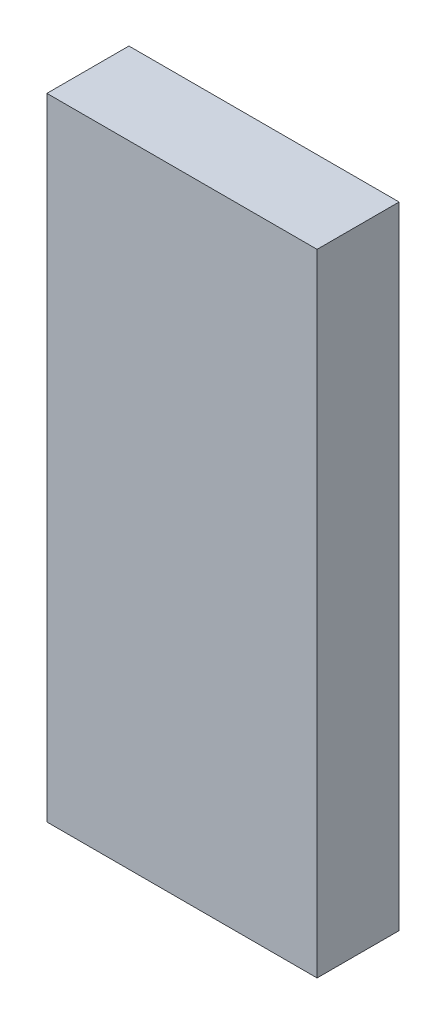
ISO-10303-21;
HEADER;
FILE_DESCRIPTION(('STEP AP214'),'2;1');
FILE_NAME('part.step','',(''),(''),'','','');
FILE_SCHEMA(('AUTOMOTIVE_DESIGN { 1 0 10303 214 1 1 1 1 }'));
ENDSEC;
DATA;
#1=APPLICATION_CONTEXT('core data for automotive mechanical design processes');
#2=APPLICATION_PROTOCOL_DEFINITION('international standard','automotive_design',2000,#1);
#3=PRODUCT_CONTEXT('',#1,'mechanical');
#4=PRODUCT('Part','Part','',(#3));
#5=PRODUCT_RELATED_PRODUCT_CATEGORY('part','',(#4));
#6=PRODUCT_DEFINITION_FORMATION('','',#4);
#7=PRODUCT_DEFINITION_CONTEXT('part definition',#1,'design');
#8=PRODUCT_DEFINITION('design','',#6,#7);
#9=PRODUCT_DEFINITION_SHAPE('','',#8);
#10=(LENGTH_UNIT() NAMED_UNIT(*) SI_UNIT(.MILLI.,.METRE.));
#11=(NAMED_UNIT(*) PLANE_ANGLE_UNIT() SI_UNIT($,.RADIAN.));
#12=(NAMED_UNIT(*) SI_UNIT($,.STERADIAN.) SOLID_ANGLE_UNIT());
#13=UNCERTAINTY_MEASURE_WITH_UNIT(LENGTH_MEASURE(1.E-05),#10,'distance_accuracy_value','');
#14=(GEOMETRIC_REPRESENTATION_CONTEXT(3) GLOBAL_UNCERTAINTY_ASSIGNED_CONTEXT((#13)) GLOBAL_UNIT_ASSIGNED_CONTEXT((#10,
#11,#12)) REPRESENTATION_CONTEXT('',''));
#15=CARTESIAN_POINT('',(0.,0.,0.));
#16=DIRECTION('',(0.,0.,1.));
#17=DIRECTION('',(1.,0.,0.));
#18=AXIS2_PLACEMENT_3D('',#15,#16,#17);
#19=CARTESIAN_POINT('',(0.70000114,-1.634998,0.42499788));
#20=DIRECTION('',(0.,0.,-1.));
#21=DIRECTION('',(0.,-1.,0.));
#22=AXIS2_PLACEMENT_3D('',#19,#20,#21);
#23=PLANE('',#22);
#24=DIRECTION('',(0.,1.,0.));
#25=VECTOR('',#24,1.);
#26=CARTESIAN_POINT('',(0.70000114,-1.634998,0.42499788));
#27=LINE('',#26,#25);
#28=CARTESIAN_POINT('',(0.70000114,-1.634998,0.42499788));
#29=VERTEX_POINT('',#28);
#30=CARTESIAN_POINT('',(0.70000114,1.63500054,0.42499788));
#31=VERTEX_POINT('',#30);
#32=EDGE_CURVE('E81',#29,#31,#27,.T.);
#33=ORIENTED_EDGE('',*,*,#32,.T.);
#34=DIRECTION('',(-1.,0.,0.));
#35=VECTOR('',#34,1.);
#36=CARTESIAN_POINT('',(0.70000114,1.63500054,0.42499788));
#37=LINE('',#36,#35);
#38=CARTESIAN_POINT('',(-0.70000114,1.63500054,0.42499788));
#39=VERTEX_POINT('',#38);
#40=EDGE_CURVE('E79',#31,#39,#37,.T.);
#41=ORIENTED_EDGE('',*,*,#40,.T.);
#42=DIRECTION('',(0.,-1.,0.));
#43=VECTOR('',#42,1.);
#44=CARTESIAN_POINT('',(-0.70000114,1.63500054,0.42499788));
#45=LINE('',#44,#43);
#46=CARTESIAN_POINT('',(-0.70000114,-1.634998,0.42499788));
#47=VERTEX_POINT('',#46);
#48=EDGE_CURVE('E68',#39,#47,#45,.T.);
#49=ORIENTED_EDGE('',*,*,#48,.T.);
#50=DIRECTION('',(1.,0.,0.));
#51=VECTOR('',#50,1.);
#52=CARTESIAN_POINT('',(-0.70000114,-1.634998,0.42499788));
#53=LINE('',#52,#51);
#54=EDGE_CURVE('E11',#47,#29,#53,.T.);
#55=ORIENTED_EDGE('',*,*,#54,.T.);
#56=EDGE_LOOP('',(#33,#41,#49,#55));
#57=FACE_BOUND('',#56,.T.);
#58=ADVANCED_FACE('F17',(#57),#23,.F.);
#59=CARTESIAN_POINT('',(0.70000114,-1.634998,0.));
#60=DIRECTION('',(0.,0.,-1.));
#61=DIRECTION('',(0.,-1.,0.));
#62=AXIS2_PLACEMENT_3D('',#59,#60,#61);
#63=PLANE('',#62);
#64=DIRECTION('',(0.,1.,0.));
#65=VECTOR('',#64,1.);
#66=CARTESIAN_POINT('',(0.70000114,-1.634998,0.));
#67=LINE('',#66,#65);
#68=CARTESIAN_POINT('',(0.70000114,-1.634998,0.));
#69=VERTEX_POINT('',#68);
#70=CARTESIAN_POINT('',(0.70000114,1.63500054,0.));
#71=VERTEX_POINT('',#70);
#72=EDGE_CURVE('E102',#69,#71,#67,.T.);
#73=ORIENTED_EDGE('',*,*,#72,.F.);
#74=DIRECTION('',(1.,0.,0.));
#75=VECTOR('',#74,1.);
#76=CARTESIAN_POINT('',(-0.70000114,-1.634998,0.));
#77=LINE('',#76,#75);
#78=CARTESIAN_POINT('',(-0.70000114,-1.634998,0.));
#79=VERTEX_POINT('',#78);
#80=EDGE_CURVE('E28',#79,#69,#77,.T.);
#81=ORIENTED_EDGE('',*,*,#80,.F.);
#82=DIRECTION('',(0.,-1.,0.));
#83=VECTOR('',#82,1.);
#84=CARTESIAN_POINT('',(-0.70000114,1.63500054,0.));
#85=LINE('',#84,#83);
#86=CARTESIAN_POINT('',(-0.70000114,1.63500054,0.));
#87=VERTEX_POINT('',#86);
#88=EDGE_CURVE('E86',#87,#79,#85,.T.);
#89=ORIENTED_EDGE('',*,*,#88,.F.);
#90=DIRECTION('',(-1.,0.,0.));
#91=VECTOR('',#90,1.);
#92=CARTESIAN_POINT('',(0.70000114,1.63500054,0.));
#93=LINE('',#92,#91);
#94=EDGE_CURVE('E89',#71,#87,#93,.T.);
#95=ORIENTED_EDGE('',*,*,#94,.F.);
#96=EDGE_LOOP('',(#73,#81,#89,#95));
#97=FACE_BOUND('',#96,.T.);
#98=ADVANCED_FACE('F121',(#97),#63,.T.);
#99=CARTESIAN_POINT('',(-0.70000114,-1.634998,0.));
#100=DIRECTION('',(0.,1.,0.));
#101=DIRECTION('',(1.,0.,0.));
#102=AXIS2_PLACEMENT_3D('',#99,#100,#101);
#103=PLANE('',#102);
#104=DIRECTION('',(0.,0.,1.));
#105=VECTOR('',#104,1.);
#106=CARTESIAN_POINT('',(-0.70000114,-1.634998,0.));
#107=LINE('',#106,#105);
#108=EDGE_CURVE('E21',#79,#47,#107,.T.);
#109=ORIENTED_EDGE('',*,*,#108,.F.);
#110=ORIENTED_EDGE('',*,*,#80,.T.);
#111=DIRECTION('',(0.,0.,1.));
#112=VECTOR('',#111,1.);
#113=CARTESIAN_POINT('',(0.70000114,-1.634998,0.));
#114=LINE('',#113,#112);
#115=EDGE_CURVE('E100',#69,#29,#114,.T.);
#116=ORIENTED_EDGE('',*,*,#115,.T.);
#117=ORIENTED_EDGE('',*,*,#54,.F.);
#118=EDGE_LOOP('',(#109,#110,#116,#117));
#119=FACE_BOUND('',#118,.T.);
#120=ADVANCED_FACE('F163',(#119),#103,.F.);
#121=CARTESIAN_POINT('',(-0.70000114,1.63500054,0.));
#122=DIRECTION('',(1.,0.,0.));
#123=DIRECTION('',(0.,1.,0.));
#124=AXIS2_PLACEMENT_3D('',#121,#122,#123);
#125=PLANE('',#124);
#126=DIRECTION('',(0.,0.,1.));
#127=VECTOR('',#126,1.);
#128=CARTESIAN_POINT('',(-0.70000114,1.63500054,0.));
#129=LINE('',#128,#127);
#130=EDGE_CURVE('E73',#87,#39,#129,.T.);
#131=ORIENTED_EDGE('',*,*,#130,.F.);
#132=ORIENTED_EDGE('',*,*,#88,.T.);
#133=ORIENTED_EDGE('',*,*,#108,.T.);
#134=ORIENTED_EDGE('',*,*,#48,.F.);
#135=EDGE_LOOP('',(#131,#132,#133,#134));
#136=FACE_BOUND('',#135,.T.);
#137=ADVANCED_FACE('F70',(#136),#125,.F.);
#138=CARTESIAN_POINT('',(0.70000114,1.63500054,0.));
#139=DIRECTION('',(0.,-1.,0.));
#140=DIRECTION('',(0.,0.,-1.));
#141=AXIS2_PLACEMENT_3D('',#138,#139,#140);
#142=PLANE('',#141);
#143=DIRECTION('',(0.,0.,1.));
#144=VECTOR('',#143,1.);
#145=CARTESIAN_POINT('',(0.70000114,1.63500054,0.));
#146=LINE('',#145,#144);
#147=EDGE_CURVE('E106',#71,#31,#146,.T.);
#148=ORIENTED_EDGE('',*,*,#147,.F.);
#149=ORIENTED_EDGE('',*,*,#94,.T.);
#150=ORIENTED_EDGE('',*,*,#130,.T.);
#151=ORIENTED_EDGE('',*,*,#40,.F.);
#152=EDGE_LOOP('',(#148,#149,#150,#151));
#153=FACE_BOUND('',#152,.T.);
#154=ADVANCED_FACE('F88',(#153),#142,.F.);
#155=CARTESIAN_POINT('',(0.70000114,-1.634998,0.));
#156=DIRECTION('',(-1.,0.,0.));
#157=DIRECTION('',(0.,0.,1.));
#158=AXIS2_PLACEMENT_3D('',#155,#156,#157);
#159=PLANE('',#158);
#160=ORIENTED_EDGE('',*,*,#115,.F.);
#161=ORIENTED_EDGE('',*,*,#72,.T.);
#162=ORIENTED_EDGE('',*,*,#147,.T.);
#163=ORIENTED_EDGE('',*,*,#32,.F.);
#164=EDGE_LOOP('',(#160,#161,#162,#163));
#165=FACE_BOUND('',#164,.T.);
#166=ADVANCED_FACE('F19',(#165),#159,.F.);
#167=CLOSED_SHELL('',(#58,#98,#120,#137,#154,#166));
#168=MANIFOLD_SOLID_BREP('B1',#167);
#169=ADVANCED_BREP_SHAPE_REPRESENTATION('',(#18,#168),#14);
#170=SHAPE_DEFINITION_REPRESENTATION(#9,#169);
ENDSEC;
END-ISO-10303-21;
